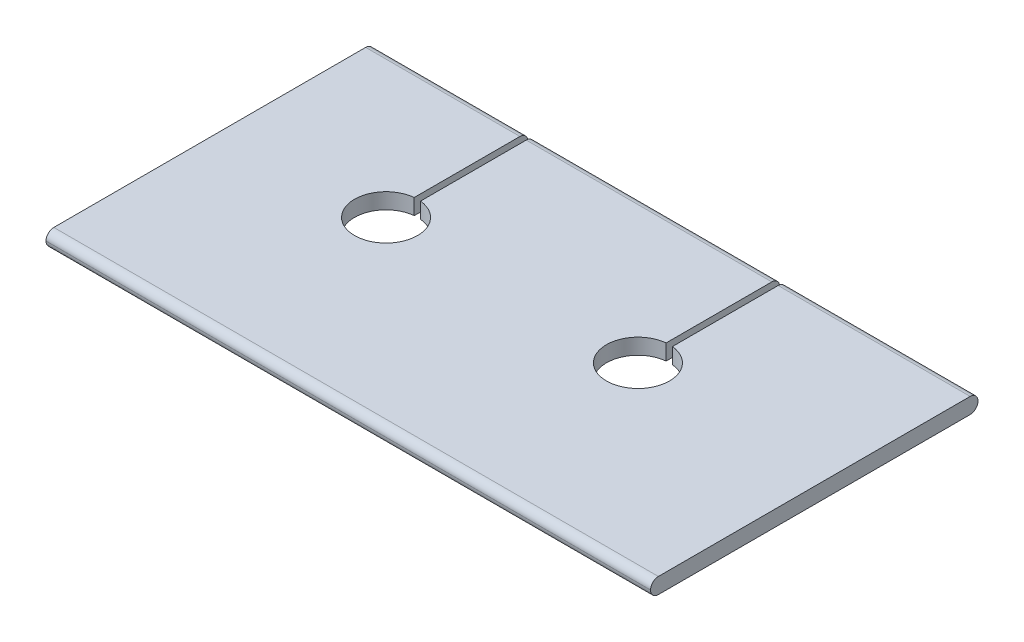
ISO-10303-21;
HEADER;
FILE_DESCRIPTION(('STEP AP214'),'2;1');
FILE_NAME('part.step','',(''),(''),'','','');
FILE_SCHEMA(('AUTOMOTIVE_DESIGN { 1 0 10303 214 1 1 1 1 }'));
ENDSEC;
DATA;
#1=APPLICATION_CONTEXT('core data for automotive mechanical design processes');
#2=APPLICATION_PROTOCOL_DEFINITION('international standard','automotive_design',2000,#1);
#3=PRODUCT_CONTEXT('',#1,'mechanical');
#4=PRODUCT('Part','Part','',(#3));
#5=PRODUCT_RELATED_PRODUCT_CATEGORY('part','',(#4));
#6=PRODUCT_DEFINITION_FORMATION('','',#4);
#7=PRODUCT_DEFINITION_CONTEXT('part definition',#1,'design');
#8=PRODUCT_DEFINITION('design','',#6,#7);
#9=PRODUCT_DEFINITION_SHAPE('','',#8);
#10=(LENGTH_UNIT() NAMED_UNIT(*) SI_UNIT(.MILLI.,.METRE.));
#11=(NAMED_UNIT(*) PLANE_ANGLE_UNIT() SI_UNIT($,.RADIAN.));
#12=(NAMED_UNIT(*) SI_UNIT($,.STERADIAN.) SOLID_ANGLE_UNIT());
#13=UNCERTAINTY_MEASURE_WITH_UNIT(LENGTH_MEASURE(1.E-05),#10,'distance_accuracy_value','');
#14=(GEOMETRIC_REPRESENTATION_CONTEXT(3) GLOBAL_UNCERTAINTY_ASSIGNED_CONTEXT((#13)) GLOBAL_UNIT_ASSIGNED_CONTEXT((#10,
#11,#12)) REPRESENTATION_CONTEXT('',''));
#15=CARTESIAN_POINT('',(0.,0.,0.));
#16=DIRECTION('',(0.,0.,1.));
#17=DIRECTION('',(1.,0.,0.));
#18=AXIS2_PLACEMENT_3D('',#15,#16,#17);
#19=CARTESIAN_POINT('',(48.,0.625000000000002,-12.38));
#20=DIRECTION('',(0.,-1.,0.));
#21=DIRECTION('',(0.,0.,-1.));
#22=AXIS2_PLACEMENT_3D('',#19,#20,#21);
#23=PLANE('',#22);
#24=DIRECTION('',(0.,0.,-1.));
#25=VECTOR('',#24,1.);
#26=CARTESIAN_POINT('',(32.25,0.625000000000001,0.));
#27=LINE('',#26,#25);
#28=CARTESIAN_POINT('',(32.25,0.625000000000001,-3.98746859276653));
#29=VERTEX_POINT('',#28);
#30=CARTESIAN_POINT('',(32.25,0.625000000000002,-12.38));
#31=VERTEX_POINT('',#30);
#32=EDGE_CURVE('E179',#29,#31,#27,.T.);
#33=ORIENTED_EDGE('',*,*,#32,.T.);
#34=DIRECTION('',(-1.,0.,0.));
#35=VECTOR('',#34,1.);
#36=CARTESIAN_POINT('',(48.,0.625000000000002,-12.38));
#37=LINE('',#36,#35);
#38=CARTESIAN_POINT('',(12.75,0.625000000000002,-12.38));
#39=VERTEX_POINT('',#38);
#40=EDGE_CURVE('E306',#31,#39,#37,.T.);
#41=ORIENTED_EDGE('',*,*,#40,.T.);
#42=DIRECTION('',(0.,0.,-1.));
#43=VECTOR('',#42,1.);
#44=CARTESIAN_POINT('',(12.75,0.625000000000001,0.));
#45=LINE('',#44,#43);
#46=CARTESIAN_POINT('',(12.75,0.625000000000001,-3.98746859276653));
#47=VERTEX_POINT('',#46);
#48=EDGE_CURVE('E218',#47,#39,#45,.T.);
#49=ORIENTED_EDGE('',*,*,#48,.F.);
#50=CARTESIAN_POINT('',(12.5,0.625000000000001,-1.49999999999998));
#51=DIRECTION('',(0.,1.,0.));
#52=DIRECTION('',(0.,0.,1.));
#53=AXIS2_PLACEMENT_3D('',#50,#51,#52);
#54=CIRCLE('',#53,2.5);
#55=CARTESIAN_POINT('',(12.25,0.625000000000001,-3.98746859276652));
#56=VERTEX_POINT('',#55);
#57=EDGE_CURVE('E225',#56,#47,#54,.T.);
#58=ORIENTED_EDGE('',*,*,#57,.F.);
#59=DIRECTION('',(0.,0.,-1.));
#60=VECTOR('',#59,1.);
#61=CARTESIAN_POINT('',(12.25,0.625000000000001,0.));
#62=LINE('',#61,#60);
#63=CARTESIAN_POINT('',(12.25,0.625000000000002,-12.38));
#64=VERTEX_POINT('',#63);
#65=EDGE_CURVE('E214',#56,#64,#62,.T.);
#66=ORIENTED_EDGE('',*,*,#65,.T.);
#67=CARTESIAN_POINT('',(0.,0.625000000000002,-12.38));
#68=VERTEX_POINT('',#67);
#69=EDGE_CURVE('E301',#64,#68,#37,.T.);
#70=ORIENTED_EDGE('',*,*,#69,.T.);
#71=DIRECTION('',(0.,0.,1.));
#72=VECTOR('',#71,1.);
#73=CARTESIAN_POINT('',(0.,0.625000000000002,-12.38));
#74=LINE('',#73,#72);
#75=CARTESIAN_POINT('',(0.,0.624999999999999,12.38));
#76=VERTEX_POINT('',#75);
#77=EDGE_CURVE('E276',#68,#76,#74,.T.);
#78=ORIENTED_EDGE('',*,*,#77,.T.);
#79=DIRECTION('',(-1.,0.,0.));
#80=VECTOR('',#79,1.);
#81=CARTESIAN_POINT('',(48.,0.624999999999999,12.38));
#82=LINE('',#81,#80);
#83=CARTESIAN_POINT('',(48.,0.624999999999999,12.38));
#84=VERTEX_POINT('',#83);
#85=EDGE_CURVE('E298',#84,#76,#82,.T.);
#86=ORIENTED_EDGE('',*,*,#85,.F.);
#87=DIRECTION('',(0.,0.,1.));
#88=VECTOR('',#87,1.);
#89=CARTESIAN_POINT('',(48.,0.625000000000002,-12.38));
#90=LINE('',#89,#88);
#91=CARTESIAN_POINT('',(48.,0.625000000000002,-12.38));
#92=VERTEX_POINT('',#91);
#93=EDGE_CURVE('E257',#92,#84,#90,.T.);
#94=ORIENTED_EDGE('',*,*,#93,.F.);
#95=CARTESIAN_POINT('',(32.75,0.625000000000002,-12.38));
#96=VERTEX_POINT('',#95);
#97=EDGE_CURVE('E302',#92,#96,#37,.T.);
#98=ORIENTED_EDGE('',*,*,#97,.T.);
#99=DIRECTION('',(0.,0.,-1.));
#100=VECTOR('',#99,1.);
#101=CARTESIAN_POINT('',(32.75,0.625000000000001,0.));
#102=LINE('',#101,#100);
#103=CARTESIAN_POINT('',(32.75,0.625000000000001,-3.98746859276653));
#104=VERTEX_POINT('',#103);
#105=EDGE_CURVE('E51',#104,#96,#102,.T.);
#106=ORIENTED_EDGE('',*,*,#105,.F.);
#107=CARTESIAN_POINT('',(32.5,0.625000000000001,-1.49999999999998));
#108=DIRECTION('',(0.,1.,0.));
#109=DIRECTION('',(0.,0.,1.));
#110=AXIS2_PLACEMENT_3D('',#107,#108,#109);
#111=CIRCLE('',#110,2.5);
#112=EDGE_CURVE('E197',#29,#104,#111,.T.);
#113=ORIENTED_EDGE('',*,*,#112,.F.);
#114=EDGE_LOOP('',(#33,#41,#49,#58,#66,#70,#78,#86,#94,#98,#106,#113));
#115=FACE_BOUND('',#114,.T.);
#116=ADVANCED_FACE('F36',(#115),#23,.F.);
#117=CARTESIAN_POINT('',(48.,-0.624999999999999,-12.38));
#118=DIRECTION('',(0.,1.,0.));
#119=DIRECTION('',(0.,0.,1.));
#120=AXIS2_PLACEMENT_3D('',#117,#118,#119);
#121=PLANE('',#120);
#122=DIRECTION('',(0.,0.,-1.));
#123=VECTOR('',#122,1.);
#124=CARTESIAN_POINT('',(32.25,-0.625000000000003,0.));
#125=LINE('',#124,#123);
#126=CARTESIAN_POINT('',(32.25,-0.625000000000003,-3.98746859276653));
#127=VERTEX_POINT('',#126);
#128=CARTESIAN_POINT('',(32.25,-0.625000000000002,-12.38));
#129=VERTEX_POINT('',#128);
#130=EDGE_CURVE('E176',#127,#129,#125,.T.);
#131=ORIENTED_EDGE('',*,*,#130,.F.);
#132=CARTESIAN_POINT('',(32.5,-0.625000000000003,-1.49999999999998));
#133=DIRECTION('',(0.,1.,0.));
#134=DIRECTION('',(0.,0.,1.));
#135=AXIS2_PLACEMENT_3D('',#132,#133,#134);
#136=CIRCLE('',#135,2.5);
#137=CARTESIAN_POINT('',(32.75,-0.625000000000003,-3.98746859276653));
#138=VERTEX_POINT('',#137);
#139=EDGE_CURVE('E187',#127,#138,#136,.T.);
#140=ORIENTED_EDGE('',*,*,#139,.T.);
#141=DIRECTION('',(0.,0.,-1.));
#142=VECTOR('',#141,1.);
#143=CARTESIAN_POINT('',(32.75,-0.625000000000003,0.));
#144=LINE('',#143,#142);
#145=CARTESIAN_POINT('',(32.75,-0.625000000000002,-12.38));
#146=VERTEX_POINT('',#145);
#147=EDGE_CURVE('E184',#138,#146,#144,.T.);
#148=ORIENTED_EDGE('',*,*,#147,.T.);
#149=DIRECTION('',(-1.,0.,0.));
#150=VECTOR('',#149,1.);
#151=CARTESIAN_POINT('',(48.,-0.624999999999999,-12.38));
#152=LINE('',#151,#150);
#153=CARTESIAN_POINT('',(48.,-0.624999999999999,-12.38));
#154=VERTEX_POINT('',#153);
#155=EDGE_CURVE('E286',#154,#146,#152,.T.);
#156=ORIENTED_EDGE('',*,*,#155,.F.);
#157=DIRECTION('',(0.,0.,-1.));
#158=VECTOR('',#157,1.);
#159=CARTESIAN_POINT('',(48.,-0.624999999999999,-12.38));
#160=LINE('',#159,#158);
#161=CARTESIAN_POINT('',(48.,-0.625000000000002,12.38));
#162=VERTEX_POINT('',#161);
#163=EDGE_CURVE('E265',#162,#154,#160,.T.);
#164=ORIENTED_EDGE('',*,*,#163,.F.);
#165=DIRECTION('',(-1.,0.,0.));
#166=VECTOR('',#165,1.);
#167=CARTESIAN_POINT('',(48.,-0.625000000000002,12.38));
#168=LINE('',#167,#166);
#169=CARTESIAN_POINT('',(0.,-0.625000000000002,12.38));
#170=VERTEX_POINT('',#169);
#171=EDGE_CURVE('E289',#162,#170,#168,.T.);
#172=ORIENTED_EDGE('',*,*,#171,.T.);
#173=DIRECTION('',(0.,0.,-1.));
#174=VECTOR('',#173,1.);
#175=CARTESIAN_POINT('',(0.,-0.624999999999999,-12.38));
#176=LINE('',#175,#174);
#177=CARTESIAN_POINT('',(0.,-0.624999999999999,-12.38));
#178=VERTEX_POINT('',#177);
#179=EDGE_CURVE('E253',#170,#178,#176,.T.);
#180=ORIENTED_EDGE('',*,*,#179,.T.);
#181=CARTESIAN_POINT('',(12.25,-0.625000000000002,-12.38));
#182=VERTEX_POINT('',#181);
#183=EDGE_CURVE('E267',#182,#178,#152,.T.);
#184=ORIENTED_EDGE('',*,*,#183,.F.);
#185=DIRECTION('',(0.,0.,-1.));
#186=VECTOR('',#185,1.);
#187=CARTESIAN_POINT('',(12.25,-0.625000000000003,0.));
#188=LINE('',#187,#186);
#189=CARTESIAN_POINT('',(12.25,-0.625000000000003,-3.98746859276652));
#190=VERTEX_POINT('',#189);
#191=EDGE_CURVE('E215',#190,#182,#188,.T.);
#192=ORIENTED_EDGE('',*,*,#191,.F.);
#193=CARTESIAN_POINT('',(12.5,-0.625000000000003,-1.49999999999998));
#194=DIRECTION('',(0.,1.,0.));
#195=DIRECTION('',(0.,0.,1.));
#196=AXIS2_PLACEMENT_3D('',#193,#194,#195);
#197=CIRCLE('',#196,2.5);
#198=CARTESIAN_POINT('',(12.75,-0.625,-3.98746859276653));
#199=VERTEX_POINT('',#198);
#200=EDGE_CURVE('E217',#190,#199,#197,.T.);
#201=ORIENTED_EDGE('',*,*,#200,.T.);
#202=DIRECTION('',(0.,0.,-1.));
#203=VECTOR('',#202,1.);
#204=CARTESIAN_POINT('',(12.75,-0.625000000000003,0.));
#205=LINE('',#204,#203);
#206=CARTESIAN_POINT('',(12.75,-0.625000000000002,-12.38));
#207=VERTEX_POINT('',#206);
#208=EDGE_CURVE('E59',#199,#207,#205,.T.);
#209=ORIENTED_EDGE('',*,*,#208,.T.);
#210=EDGE_CURVE('E195',#129,#207,#152,.T.);
#211=ORIENTED_EDGE('',*,*,#210,.F.);
#212=EDGE_LOOP('',(#131,#140,#148,#156,#164,#172,#180,#184,#192,#201,#209,#211));
#213=FACE_BOUND('',#212,.T.);
#214=ADVANCED_FACE('F194',(#213),#121,.F.);
#215=CARTESIAN_POINT('',(48.,-0.00499999999999893,-12.38));
#216=DIRECTION('',(-1.,0.,0.));
#217=DIRECTION('',(0.,0.,1.));
#218=AXIS2_PLACEMENT_3D('',#215,#216,#217);
#219=CYLINDRICAL_SURFACE('',#218,0.62);
#220=CARTESIAN_POINT('',(32.25,-0.00499999999999893,-12.38));
#221=DIRECTION('',(1.,0.,0.));
#222=DIRECTION('',(0.,0.,-1.));
#223=AXIS2_PLACEMENT_3D('',#220,#221,#222);
#224=CIRCLE('',#223,0.62);
#225=CARTESIAN_POINT('',(32.25,-0.00499999999999459,-13.));
#226=VERTEX_POINT('',#225);
#227=EDGE_CURVE('E212',#129,#226,#224,.T.);
#228=ORIENTED_EDGE('',*,*,#227,.F.);
#229=ORIENTED_EDGE('',*,*,#210,.T.);
#230=CARTESIAN_POINT('',(12.75,-0.00499999999999893,-12.38));
#231=DIRECTION('',(1.,0.,0.));
#232=DIRECTION('',(0.,0.,-1.));
#233=AXIS2_PLACEMENT_3D('',#230,#231,#232);
#234=CIRCLE('',#233,0.62);
#235=CARTESIAN_POINT('',(12.75,-0.00499999999999459,-13.));
#236=VERTEX_POINT('',#235);
#237=EDGE_CURVE('E239',#207,#236,#234,.T.);
#238=ORIENTED_EDGE('',*,*,#237,.T.);
#239=DIRECTION('',(-1.,0.,0.));
#240=VECTOR('',#239,1.);
#241=CARTESIAN_POINT('',(48.,-0.00499999999999459,-13.));
#242=LINE('',#241,#240);
#243=EDGE_CURVE('E314',#226,#236,#242,.T.);
#244=ORIENTED_EDGE('',*,*,#243,.F.);
#245=EDGE_LOOP('',(#228,#229,#238,#244));
#246=FACE_BOUND('',#245,.T.);
#247=ADVANCED_FACE('F376',(#246),#219,.T.);
#248=CARTESIAN_POINT('',(48.,0.00499999999999784,-13.));
#249=DIRECTION('',(0.,0.,1.));
#250=DIRECTION('',(1.,0.,0.));
#251=AXIS2_PLACEMENT_3D('',#248,#249,#250);
#252=PLANE('',#251);
#253=DIRECTION('',(0.,1.,0.));
#254=VECTOR('',#253,1.);
#255=CARTESIAN_POINT('',(32.25,0.00499999999999784,-13.));
#256=LINE('',#255,#254);
#257=CARTESIAN_POINT('',(32.25,0.00500000000000218,-13.));
#258=VERTEX_POINT('',#257);
#259=EDGE_CURVE('E210',#226,#258,#256,.T.);
#260=ORIENTED_EDGE('',*,*,#259,.F.);
#261=ORIENTED_EDGE('',*,*,#243,.T.);
#262=DIRECTION('',(0.,1.,0.));
#263=VECTOR('',#262,1.);
#264=CARTESIAN_POINT('',(12.75,0.00499999999999784,-13.));
#265=LINE('',#264,#263);
#266=CARTESIAN_POINT('',(12.75,0.00500000000000218,-13.));
#267=VERTEX_POINT('',#266);
#268=EDGE_CURVE('E236',#236,#267,#265,.T.);
#269=ORIENTED_EDGE('',*,*,#268,.T.);
#270=DIRECTION('',(-1.,0.,0.));
#271=VECTOR('',#270,1.);
#272=CARTESIAN_POINT('',(48.,0.00499999999999784,-13.));
#273=LINE('',#272,#271);
#274=EDGE_CURVE('E311',#258,#267,#273,.T.);
#275=ORIENTED_EDGE('',*,*,#274,.F.);
#276=EDGE_LOOP('',(#260,#261,#269,#275));
#277=FACE_BOUND('',#276,.T.);
#278=ADVANCED_FACE('F385',(#277),#252,.F.);
#279=CARTESIAN_POINT('',(48.,0.00500000000000218,-12.38));
#280=DIRECTION('',(-1.,0.,0.));
#281=DIRECTION('',(0.,0.,1.));
#282=AXIS2_PLACEMENT_3D('',#279,#280,#281);
#283=CYLINDRICAL_SURFACE('',#282,0.619999999999999);
#284=CARTESIAN_POINT('',(32.25,0.00500000000000218,-12.38));
#285=DIRECTION('',(1.,0.,0.));
#286=DIRECTION('',(0.,0.,-1.));
#287=AXIS2_PLACEMENT_3D('',#284,#285,#286);
#288=CIRCLE('',#287,0.619999999999999);
#289=EDGE_CURVE('E11',#258,#31,#288,.T.);
#290=ORIENTED_EDGE('',*,*,#289,.F.);
#291=ORIENTED_EDGE('',*,*,#274,.T.);
#292=CARTESIAN_POINT('',(12.75,0.00500000000000218,-12.38));
#293=DIRECTION('',(1.,0.,0.));
#294=DIRECTION('',(0.,0.,-1.));
#295=AXIS2_PLACEMENT_3D('',#292,#293,#294);
#296=CIRCLE('',#295,0.619999999999999);
#297=EDGE_CURVE('E232',#267,#39,#296,.T.);
#298=ORIENTED_EDGE('',*,*,#297,.T.);
#299=ORIENTED_EDGE('',*,*,#40,.F.);
#300=EDGE_LOOP('',(#290,#291,#298,#299));
#301=FACE_BOUND('',#300,.T.);
#302=ADVANCED_FACE('F339',(#301),#283,.T.);
#303=CARTESIAN_POINT('',(12.25,-0.00499999999999893,-12.38));
#304=DIRECTION('',(1.,0.,0.));
#305=DIRECTION('',(0.,0.,-1.));
#306=AXIS2_PLACEMENT_3D('',#303,#304,#305);
#307=CIRCLE('',#306,0.62);
#308=CARTESIAN_POINT('',(12.25,-0.00499999999999459,-13.));
#309=VERTEX_POINT('',#308);
#310=EDGE_CURVE('E246',#182,#309,#307,.T.);
#311=ORIENTED_EDGE('',*,*,#310,.F.);
#312=ORIENTED_EDGE('',*,*,#183,.T.);
#313=CARTESIAN_POINT('',(0.,-0.00499999999999893,-12.38));
#314=DIRECTION('',(1.,0.,0.));
#315=DIRECTION('',(0.,0.,1.));
#316=AXIS2_PLACEMENT_3D('',#313,#314,#315);
#317=CIRCLE('',#316,0.62);
#318=CARTESIAN_POINT('',(0.,-0.00499999999999459,-13.));
#319=VERTEX_POINT('',#318);
#320=EDGE_CURVE('E248',#178,#319,#317,.T.);
#321=ORIENTED_EDGE('',*,*,#320,.T.);
#322=EDGE_CURVE('E310',#309,#319,#242,.T.);
#323=ORIENTED_EDGE('',*,*,#322,.F.);
#324=EDGE_LOOP('',(#311,#312,#321,#323));
#325=FACE_BOUND('',#324,.T.);
#326=ADVANCED_FACE('F373',(#325),#219,.T.);
#327=DIRECTION('',(0.,1.,0.));
#328=VECTOR('',#327,1.);
#329=CARTESIAN_POINT('',(12.25,0.00499999999999784,-13.));
#330=LINE('',#329,#328);
#331=CARTESIAN_POINT('',(12.25,0.00500000000000218,-13.));
#332=VERTEX_POINT('',#331);
#333=EDGE_CURVE('E244',#309,#332,#330,.T.);
#334=ORIENTED_EDGE('',*,*,#333,.F.);
#335=ORIENTED_EDGE('',*,*,#322,.T.);
#336=DIRECTION('',(0.,1.,0.));
#337=VECTOR('',#336,1.);
#338=CARTESIAN_POINT('',(0.,0.00499999999999784,-13.));
#339=LINE('',#338,#337);
#340=CARTESIAN_POINT('',(0.,0.00499999999999784,-13.));
#341=VERTEX_POINT('',#340);
#342=EDGE_CURVE('E270',#319,#341,#339,.T.);
#343=ORIENTED_EDGE('',*,*,#342,.T.);
#344=EDGE_CURVE('E305',#332,#341,#273,.T.);
#345=ORIENTED_EDGE('',*,*,#344,.F.);
#346=EDGE_LOOP('',(#334,#335,#343,#345));
#347=FACE_BOUND('',#346,.T.);
#348=ADVANCED_FACE('F388',(#347),#252,.F.);
#349=CARTESIAN_POINT('',(12.25,0.00500000000000218,-12.38));
#350=DIRECTION('',(1.,0.,0.));
#351=DIRECTION('',(0.,0.,-1.));
#352=AXIS2_PLACEMENT_3D('',#349,#350,#351);
#353=CIRCLE('',#352,0.619999999999999);
#354=EDGE_CURVE('E242',#332,#64,#353,.T.);
#355=ORIENTED_EDGE('',*,*,#354,.F.);
#356=ORIENTED_EDGE('',*,*,#344,.T.);
#357=CARTESIAN_POINT('',(0.,0.00500000000000218,-12.38));
#358=DIRECTION('',(1.,0.,0.));
#359=DIRECTION('',(0.,0.,1.));
#360=AXIS2_PLACEMENT_3D('',#357,#358,#359);
#361=CIRCLE('',#360,0.619999999999999);
#362=EDGE_CURVE('E273',#341,#68,#361,.T.);
#363=ORIENTED_EDGE('',*,*,#362,.T.);
#364=ORIENTED_EDGE('',*,*,#69,.F.);
#365=EDGE_LOOP('',(#355,#356,#363,#364));
#366=FACE_BOUND('',#365,.T.);
#367=ADVANCED_FACE('F349',(#366),#283,.T.);
#368=ORIENTED_EDGE('',*,*,#155,.T.);
#369=CARTESIAN_POINT('',(32.75,-0.00499999999999893,-12.38));
#370=DIRECTION('',(1.,0.,0.));
#371=DIRECTION('',(0.,0.,-1.));
#372=AXIS2_PLACEMENT_3D('',#369,#370,#371);
#373=CIRCLE('',#372,0.62);
#374=CARTESIAN_POINT('',(32.75,-0.00499999999999459,-13.));
#375=VERTEX_POINT('',#374);
#376=EDGE_CURVE('E207',#146,#375,#373,.T.);
#377=ORIENTED_EDGE('',*,*,#376,.T.);
#378=CARTESIAN_POINT('',(48.,-0.00499999999999459,-13.));
#379=VERTEX_POINT('',#378);
#380=EDGE_CURVE('E312',#379,#375,#242,.T.);
#381=ORIENTED_EDGE('',*,*,#380,.F.);
#382=CARTESIAN_POINT('',(48.,-0.00499999999999893,-12.38));
#383=DIRECTION('',(1.,0.,0.));
#384=DIRECTION('',(0.,0.,1.));
#385=AXIS2_PLACEMENT_3D('',#382,#383,#384);
#386=CIRCLE('',#385,0.62);
#387=EDGE_CURVE('E249',#154,#379,#386,.T.);
#388=ORIENTED_EDGE('',*,*,#387,.F.);
#389=EDGE_LOOP('',(#368,#377,#381,#388));
#390=FACE_BOUND('',#389,.T.);
#391=ADVANCED_FACE('F38',(#390),#219,.T.);
#392=ORIENTED_EDGE('',*,*,#380,.T.);
#393=DIRECTION('',(0.,1.,0.));
#394=VECTOR('',#393,1.);
#395=CARTESIAN_POINT('',(32.75,0.00499999999999784,-13.));
#396=LINE('',#395,#394);
#397=CARTESIAN_POINT('',(32.75,0.00500000000000218,-13.));
#398=VERTEX_POINT('',#397);
#399=EDGE_CURVE('E203',#375,#398,#396,.T.);
#400=ORIENTED_EDGE('',*,*,#399,.T.);
#401=CARTESIAN_POINT('',(48.,0.00499999999999784,-13.));
#402=VERTEX_POINT('',#401);
#403=EDGE_CURVE('E307',#402,#398,#273,.T.);
#404=ORIENTED_EDGE('',*,*,#403,.F.);
#405=DIRECTION('',(0.,1.,0.));
#406=VECTOR('',#405,1.);
#407=CARTESIAN_POINT('',(48.,0.00499999999999784,-13.));
#408=LINE('',#407,#406);
#409=EDGE_CURVE('E252',#379,#402,#408,.T.);
#410=ORIENTED_EDGE('',*,*,#409,.F.);
#411=EDGE_LOOP('',(#392,#400,#404,#410));
#412=FACE_BOUND('',#411,.T.);
#413=ADVANCED_FACE('F330',(#412),#252,.F.);
#414=ORIENTED_EDGE('',*,*,#403,.T.);
#415=CARTESIAN_POINT('',(32.75,0.00500000000000218,-12.38));
#416=DIRECTION('',(1.,0.,0.));
#417=DIRECTION('',(0.,0.,-1.));
#418=AXIS2_PLACEMENT_3D('',#415,#416,#417);
#419=CIRCLE('',#418,0.619999999999999);
#420=EDGE_CURVE('E44',#398,#96,#419,.T.);
#421=ORIENTED_EDGE('',*,*,#420,.T.);
#422=ORIENTED_EDGE('',*,*,#97,.F.);
#423=CARTESIAN_POINT('',(48.,0.00500000000000218,-12.38));
#424=DIRECTION('',(1.,0.,0.));
#425=DIRECTION('',(0.,0.,1.));
#426=AXIS2_PLACEMENT_3D('',#423,#424,#425);
#427=CIRCLE('',#426,0.619999999999999);
#428=EDGE_CURVE('E255',#402,#92,#427,.T.);
#429=ORIENTED_EDGE('',*,*,#428,.F.);
#430=EDGE_LOOP('',(#414,#421,#422,#429));
#431=FACE_BOUND('',#430,.T.);
#432=ADVANCED_FACE('F317',(#431),#283,.T.);
#433=CARTESIAN_POINT('',(48.,0.00499999999999893,12.38));
#434=DIRECTION('',(-1.,0.,0.));
#435=DIRECTION('',(0.,0.,1.));
#436=AXIS2_PLACEMENT_3D('',#433,#434,#435);
#437=CYLINDRICAL_SURFACE('',#436,0.62);
#438=CARTESIAN_POINT('',(0.,0.00499999999999893,12.38));
#439=DIRECTION('',(1.,0.,0.));
#440=DIRECTION('',(0.,0.,-1.));
#441=AXIS2_PLACEMENT_3D('',#438,#439,#440);
#442=CIRCLE('',#441,0.62);
#443=CARTESIAN_POINT('',(0.,0.00499999999999295,13.));
#444=VERTEX_POINT('',#443);
#445=EDGE_CURVE('E278',#76,#444,#442,.T.);
#446=ORIENTED_EDGE('',*,*,#445,.T.);
#447=DIRECTION('',(-1.,0.,0.));
#448=VECTOR('',#447,1.);
#449=CARTESIAN_POINT('',(48.,0.00499999999999295,13.));
#450=LINE('',#449,#448);
#451=CARTESIAN_POINT('',(48.,0.00499999999999295,13.));
#452=VERTEX_POINT('',#451);
#453=EDGE_CURVE('E295',#452,#444,#450,.T.);
#454=ORIENTED_EDGE('',*,*,#453,.F.);
#455=CARTESIAN_POINT('',(48.,0.00499999999999893,12.38));
#456=DIRECTION('',(1.,0.,0.));
#457=DIRECTION('',(0.,0.,-1.));
#458=AXIS2_PLACEMENT_3D('',#455,#456,#457);
#459=CIRCLE('',#458,0.62);
#460=EDGE_CURVE('E259',#84,#452,#459,.T.);
#461=ORIENTED_EDGE('',*,*,#460,.F.);
#462=ORIENTED_EDGE('',*,*,#85,.T.);
#463=EDGE_LOOP('',(#446,#454,#461,#462));
#464=FACE_BOUND('',#463,.T.);
#465=ADVANCED_FACE('F359',(#464),#437,.T.);
#466=CARTESIAN_POINT('',(48.,0.00499999999999275,13.));
#467=DIRECTION('',(0.,0.,-1.));
#468=DIRECTION('',(-1.,0.,0.));
#469=AXIS2_PLACEMENT_3D('',#466,#467,#468);
#470=PLANE('',#469);
#471=DIRECTION('',(0.,-1.,0.));
#472=VECTOR('',#471,1.);
#473=CARTESIAN_POINT('',(0.,0.00499999999999275,13.));
#474=LINE('',#473,#472);
#475=CARTESIAN_POINT('',(0.,-0.00499999999999871,13.));
#476=VERTEX_POINT('',#475);
#477=EDGE_CURVE('E280',#444,#476,#474,.T.);
#478=ORIENTED_EDGE('',*,*,#477,.T.);
#479=DIRECTION('',(-1.,0.,0.));
#480=VECTOR('',#479,1.);
#481=CARTESIAN_POINT('',(48.,-0.00499999999999871,13.));
#482=LINE('',#481,#480);
#483=CARTESIAN_POINT('',(48.,-0.00499999999999871,13.));
#484=VERTEX_POINT('',#483);
#485=EDGE_CURVE('E292',#484,#476,#482,.T.);
#486=ORIENTED_EDGE('',*,*,#485,.F.);
#487=DIRECTION('',(0.,-1.,0.));
#488=VECTOR('',#487,1.);
#489=CARTESIAN_POINT('',(48.,0.00499999999999275,13.));
#490=LINE('',#489,#488);
#491=EDGE_CURVE('E261',#452,#484,#490,.T.);
#492=ORIENTED_EDGE('',*,*,#491,.F.);
#493=ORIENTED_EDGE('',*,*,#453,.T.);
#494=EDGE_LOOP('',(#478,#486,#492,#493));
#495=FACE_BOUND('',#494,.T.);
#496=ADVANCED_FACE('F362',(#495),#470,.F.);
#497=CARTESIAN_POINT('',(48.,-0.00500000000000229,12.38));
#498=DIRECTION('',(-1.,0.,0.));
#499=DIRECTION('',(0.,0.,1.));
#500=AXIS2_PLACEMENT_3D('',#497,#498,#499);
#501=CYLINDRICAL_SURFACE('',#500,0.619999999999999);
#502=CARTESIAN_POINT('',(0.,-0.00500000000000229,12.38));
#503=DIRECTION('',(1.,0.,0.));
#504=DIRECTION('',(0.,0.,1.));
#505=AXIS2_PLACEMENT_3D('',#502,#503,#504);
#506=CIRCLE('',#505,0.619999999999999);
#507=EDGE_CURVE('E282',#476,#170,#506,.T.);
#508=ORIENTED_EDGE('',*,*,#507,.T.);
#509=ORIENTED_EDGE('',*,*,#171,.F.);
#510=CARTESIAN_POINT('',(48.,-0.00500000000000229,12.38));
#511=DIRECTION('',(1.,0.,0.));
#512=DIRECTION('',(0.,0.,1.));
#513=AXIS2_PLACEMENT_3D('',#510,#511,#512);
#514=CIRCLE('',#513,0.619999999999999);
#515=EDGE_CURVE('E263',#484,#162,#514,.T.);
#516=ORIENTED_EDGE('',*,*,#515,.F.);
#517=ORIENTED_EDGE('',*,*,#485,.T.);
#518=EDGE_LOOP('',(#508,#509,#516,#517));
#519=FACE_BOUND('',#518,.T.);
#520=ADVANCED_FACE('F367',(#519),#501,.T.);
#521=CARTESIAN_POINT('',(48.,-0.00499999999999893,-12.38));
#522=DIRECTION('',(-1.,0.,0.));
#523=DIRECTION('',(0.,0.,1.));
#524=AXIS2_PLACEMENT_3D('',#521,#522,#523);
#525=PLANE('',#524);
#526=ORIENTED_EDGE('',*,*,#387,.T.);
#527=ORIENTED_EDGE('',*,*,#409,.T.);
#528=ORIENTED_EDGE('',*,*,#428,.T.);
#529=ORIENTED_EDGE('',*,*,#93,.T.);
#530=ORIENTED_EDGE('',*,*,#460,.T.);
#531=ORIENTED_EDGE('',*,*,#491,.T.);
#532=ORIENTED_EDGE('',*,*,#515,.T.);
#533=ORIENTED_EDGE('',*,*,#163,.T.);
#534=EDGE_LOOP('',(#526,#527,#528,#529,#530,#531,#532,#533));
#535=FACE_BOUND('',#534,.T.);
#536=ADVANCED_FACE('F325',(#535),#525,.F.);
#537=CARTESIAN_POINT('',(0.,-0.00499999999999893,-12.38));
#538=DIRECTION('',(-1.,0.,0.));
#539=DIRECTION('',(0.,0.,1.));
#540=AXIS2_PLACEMENT_3D('',#537,#538,#539);
#541=PLANE('',#540);
#542=ORIENTED_EDGE('',*,*,#320,.F.);
#543=ORIENTED_EDGE('',*,*,#179,.F.);
#544=ORIENTED_EDGE('',*,*,#507,.F.);
#545=ORIENTED_EDGE('',*,*,#477,.F.);
#546=ORIENTED_EDGE('',*,*,#445,.F.);
#547=ORIENTED_EDGE('',*,*,#77,.F.);
#548=ORIENTED_EDGE('',*,*,#362,.F.);
#549=ORIENTED_EDGE('',*,*,#342,.F.);
#550=EDGE_LOOP('',(#542,#543,#544,#545,#546,#547,#548,#549));
#551=FACE_BOUND('',#550,.T.);
#552=ADVANCED_FACE('F355',(#551),#541,.T.);
#553=CARTESIAN_POINT('',(12.25,-0.625000000000003,0.));
#554=DIRECTION('',(1.,0.,0.));
#555=DIRECTION('',(0.,0.,-1.));
#556=AXIS2_PLACEMENT_3D('',#553,#554,#555);
#557=PLANE('',#556);
#558=ORIENTED_EDGE('',*,*,#310,.T.);
#559=ORIENTED_EDGE('',*,*,#333,.T.);
#560=ORIENTED_EDGE('',*,*,#354,.T.);
#561=ORIENTED_EDGE('',*,*,#65,.F.);
#562=DIRECTION('',(0.,1.,0.));
#563=VECTOR('',#562,1.);
#564=CARTESIAN_POINT('',(12.25,-0.625000000000003,-3.98746859276652));
#565=LINE('',#564,#563);
#566=EDGE_CURVE('E222',#190,#56,#565,.T.);
#567=ORIENTED_EDGE('',*,*,#566,.F.);
#568=ORIENTED_EDGE('',*,*,#191,.T.);
#569=EDGE_LOOP('',(#558,#559,#560,#561,#567,#568));
#570=FACE_BOUND('',#569,.T.);
#571=ADVANCED_FACE('F390',(#570),#557,.T.);
#572=CARTESIAN_POINT('',(12.75,-0.625000000000003,0.));
#573=DIRECTION('',(1.,0.,0.));
#574=DIRECTION('',(0.,0.,-1.));
#575=AXIS2_PLACEMENT_3D('',#572,#573,#574);
#576=PLANE('',#575);
#577=ORIENTED_EDGE('',*,*,#208,.F.);
#578=DIRECTION('',(0.,1.,0.));
#579=VECTOR('',#578,1.);
#580=CARTESIAN_POINT('',(12.75,-0.625000000000003,-3.98746859276653));
#581=LINE('',#580,#579);
#582=EDGE_CURVE('E230',#199,#47,#581,.T.);
#583=ORIENTED_EDGE('',*,*,#582,.T.);
#584=ORIENTED_EDGE('',*,*,#48,.T.);
#585=ORIENTED_EDGE('',*,*,#297,.F.);
#586=ORIENTED_EDGE('',*,*,#268,.F.);
#587=ORIENTED_EDGE('',*,*,#237,.F.);
#588=EDGE_LOOP('',(#577,#583,#584,#585,#586,#587));
#589=FACE_BOUND('',#588,.T.);
#590=ADVANCED_FACE('F379',(#589),#576,.F.);
#591=CARTESIAN_POINT('',(12.5,-0.625000000000003,-1.49999999999998));
#592=DIRECTION('',(0.,1.,0.));
#593=DIRECTION('',(0.,0.,1.));
#594=AXIS2_PLACEMENT_3D('',#591,#592,#593);
#595=CYLINDRICAL_SURFACE('',#594,2.5);
#596=ORIENTED_EDGE('',*,*,#57,.T.);
#597=ORIENTED_EDGE('',*,*,#582,.F.);
#598=ORIENTED_EDGE('',*,*,#200,.F.);
#599=ORIENTED_EDGE('',*,*,#566,.T.);
#600=EDGE_LOOP('',(#596,#597,#598,#599));
#601=FACE_BOUND('',#600,.T.);
#602=ADVANCED_FACE('F382',(#601),#595,.F.);
#603=CARTESIAN_POINT('',(32.25,-0.625000000000003,0.));
#604=DIRECTION('',(1.,0.,0.));
#605=DIRECTION('',(0.,0.,-1.));
#606=AXIS2_PLACEMENT_3D('',#603,#604,#605);
#607=PLANE('',#606);
#608=ORIENTED_EDGE('',*,*,#227,.T.);
#609=ORIENTED_EDGE('',*,*,#259,.T.);
#610=ORIENTED_EDGE('',*,*,#289,.T.);
#611=ORIENTED_EDGE('',*,*,#32,.F.);
#612=DIRECTION('',(0.,1.,0.));
#613=VECTOR('',#612,1.);
#614=CARTESIAN_POINT('',(32.25,-0.625000000000003,-3.98746859276653));
#615=LINE('',#614,#613);
#616=EDGE_CURVE('E172',#127,#29,#615,.T.);
#617=ORIENTED_EDGE('',*,*,#616,.F.);
#618=ORIENTED_EDGE('',*,*,#130,.T.);
#619=EDGE_LOOP('',(#608,#609,#610,#611,#617,#618));
#620=FACE_BOUND('',#619,.T.);
#621=ADVANCED_FACE('F174',(#620),#607,.T.);
#622=CARTESIAN_POINT('',(32.75,-0.625000000000003,0.));
#623=DIRECTION('',(1.,0.,0.));
#624=DIRECTION('',(0.,0.,-1.));
#625=AXIS2_PLACEMENT_3D('',#622,#623,#624);
#626=PLANE('',#625);
#627=ORIENTED_EDGE('',*,*,#147,.F.);
#628=DIRECTION('',(0.,1.,0.));
#629=VECTOR('',#628,1.);
#630=CARTESIAN_POINT('',(32.75,-0.625000000000003,-3.98746859276653));
#631=LINE('',#630,#629);
#632=EDGE_CURVE('E183',#138,#104,#631,.T.);
#633=ORIENTED_EDGE('',*,*,#632,.T.);
#634=ORIENTED_EDGE('',*,*,#105,.T.);
#635=ORIENTED_EDGE('',*,*,#420,.F.);
#636=ORIENTED_EDGE('',*,*,#399,.F.);
#637=ORIENTED_EDGE('',*,*,#376,.F.);
#638=EDGE_LOOP('',(#627,#633,#634,#635,#636,#637));
#639=FACE_BOUND('',#638,.T.);
#640=ADVANCED_FACE('F331',(#639),#626,.F.);
#641=CARTESIAN_POINT('',(32.5,-0.625000000000003,-1.49999999999998));
#642=DIRECTION('',(0.,1.,0.));
#643=DIRECTION('',(0.,0.,1.));
#644=AXIS2_PLACEMENT_3D('',#641,#642,#643);
#645=CYLINDRICAL_SURFACE('',#644,2.5);
#646=ORIENTED_EDGE('',*,*,#112,.T.);
#647=ORIENTED_EDGE('',*,*,#632,.F.);
#648=ORIENTED_EDGE('',*,*,#139,.F.);
#649=ORIENTED_EDGE('',*,*,#616,.T.);
#650=EDGE_LOOP('',(#646,#647,#648,#649));
#651=FACE_BOUND('',#650,.T.);
#652=ADVANCED_FACE('F188',(#651),#645,.F.);
#653=CLOSED_SHELL('',(#116,#214,#247,#278,#302,#326,#348,#367,#391,#413,#432,#465,#496,#520,
#536,#552,#571,#590,#602,#621,#640,#652));
#654=MANIFOLD_SOLID_BREP('B2',#653);
#655=ADVANCED_BREP_SHAPE_REPRESENTATION('',(#18,#654),#14);
#656=SHAPE_DEFINITION_REPRESENTATION(#9,#655);
ENDSEC;
END-ISO-10303-21;
